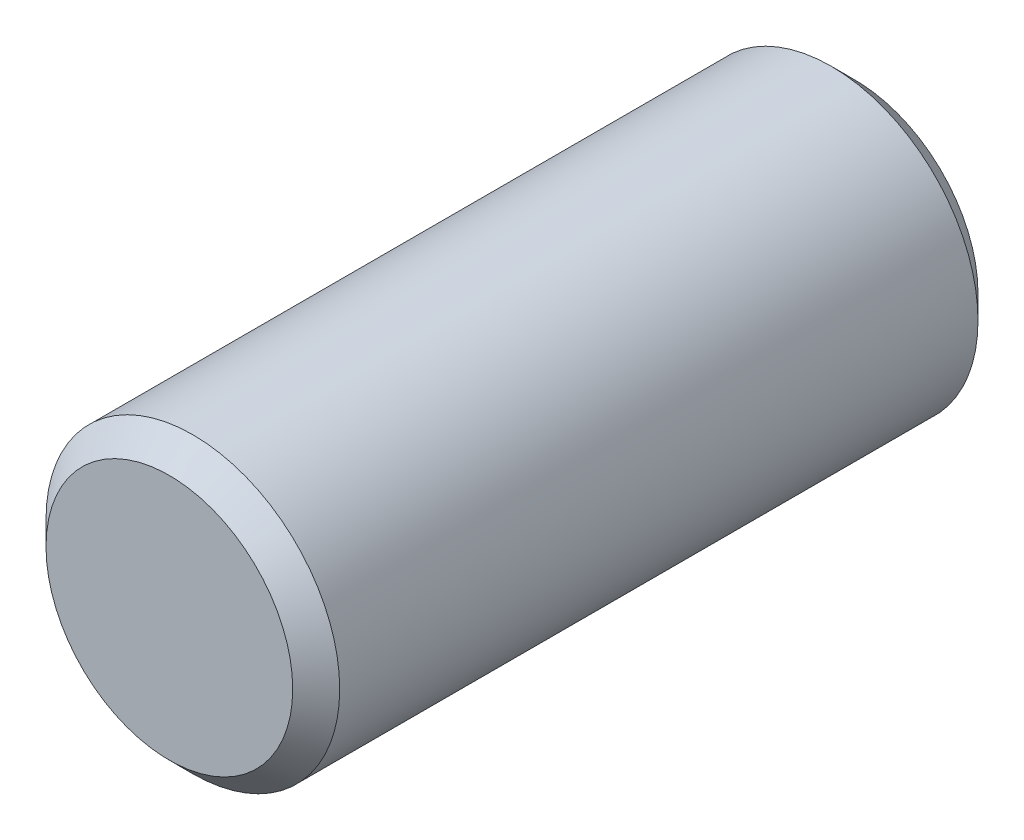
ISO-10303-21;
HEADER;
FILE_DESCRIPTION(('STEP AP214'),'2;1');
FILE_NAME('part.step','',(''),(''),'','','');
FILE_SCHEMA(('AUTOMOTIVE_DESIGN { 1 0 10303 214 1 1 1 1 }'));
ENDSEC;
DATA;
#1=APPLICATION_CONTEXT('core data for automotive mechanical design processes');
#2=APPLICATION_PROTOCOL_DEFINITION('international standard','automotive_design',2000,#1);
#3=PRODUCT_CONTEXT('',#1,'mechanical');
#4=PRODUCT('Part','Part','',(#3));
#5=PRODUCT_RELATED_PRODUCT_CATEGORY('part','',(#4));
#6=PRODUCT_DEFINITION_FORMATION('','',#4);
#7=PRODUCT_DEFINITION_CONTEXT('part definition',#1,'design');
#8=PRODUCT_DEFINITION('design','',#6,#7);
#9=PRODUCT_DEFINITION_SHAPE('','',#8);
#10=(LENGTH_UNIT() NAMED_UNIT(*) SI_UNIT(.MILLI.,.METRE.));
#11=(NAMED_UNIT(*) PLANE_ANGLE_UNIT() SI_UNIT($,.RADIAN.));
#12=(NAMED_UNIT(*) SI_UNIT($,.STERADIAN.) SOLID_ANGLE_UNIT());
#13=UNCERTAINTY_MEASURE_WITH_UNIT(LENGTH_MEASURE(1.E-05),#10,'distance_accuracy_value','');
#14=(GEOMETRIC_REPRESENTATION_CONTEXT(3) GLOBAL_UNCERTAINTY_ASSIGNED_CONTEXT((#13)) GLOBAL_UNIT_ASSIGNED_CONTEXT((#10,
#11,#12)) REPRESENTATION_CONTEXT('',''));
#15=CARTESIAN_POINT('',(0.,0.,0.));
#16=DIRECTION('',(0.,0.,1.));
#17=DIRECTION('',(1.,0.,0.));
#18=AXIS2_PLACEMENT_3D('',#15,#16,#17);
#19=CARTESIAN_POINT('',(0.,0.,0.));
#20=DIRECTION('',(0.,0.,-1.));
#21=DIRECTION('',(-1.,0.,0.));
#22=AXIS2_PLACEMENT_3D('',#19,#20,#21);
#23=PLANE('',#22);
#24=CARTESIAN_POINT('',(0.,0.,0.));
#25=DIRECTION('',(0.,0.,1.));
#26=DIRECTION('',(1.,0.,0.));
#27=AXIS2_PLACEMENT_3D('',#24,#25,#26);
#28=CIRCLE('',#27,2.0002499999805);
#29=CARTESIAN_POINT('',(2.0002499999805,0.,0.));
#30=VERTEX_POINT('',#29);
#31=EDGE_CURVE('E18',#30,#30,#28,.T.);
#32=ORIENTED_EDGE('',*,*,#31,.F.);
#33=EDGE_LOOP('',(#32));
#34=FACE_BOUND('',#33,.T.);
#35=ADVANCED_FACE('F15',(#34),#23,.T.);
#36=CARTESIAN_POINT('',(0.,0.,11.1125));
#37=DIRECTION('',(0.,0.,1.));
#38=DIRECTION('',(1.,0.,0.));
#39=AXIS2_PLACEMENT_3D('',#36,#37,#38);
#40=PLANE('',#39);
#41=CARTESIAN_POINT('',(0.,0.,11.1125000000811));
#42=DIRECTION('',(0.,0.,-1.));
#43=DIRECTION('',(-1.,0.,0.));
#44=AXIS2_PLACEMENT_3D('',#41,#42,#43);
#45=CIRCLE('',#44,2.0002499999805);
#46=CARTESIAN_POINT('',(-2.0002499999805,0.,11.1125000000811));
#47=VERTEX_POINT('',#46);
#48=EDGE_CURVE('E27',#47,#47,#45,.T.);
#49=ORIENTED_EDGE('',*,*,#48,.F.);
#50=EDGE_LOOP('',(#49));
#51=FACE_BOUND('',#50,.T.);
#52=ADVANCED_FACE('F38',(#51),#40,.T.);
#53=CARTESIAN_POINT('',(0.,0.,0.381000000004406));
#54=DIRECTION('',(0.,0.,1.));
#55=DIRECTION('',(1.,0.,0.));
#56=AXIS2_PLACEMENT_3D('',#53,#54,#55);
#57=CONICAL_SURFACE('',#56,2.3812499999849,0.785398163397448);
#58=CARTESIAN_POINT('',(0.,0.,0.381));
#59=DIRECTION('',(0.,0.,1.));
#60=DIRECTION('',(1.,0.,0.));
#61=AXIS2_PLACEMENT_3D('',#58,#59,#60);
#62=CIRCLE('',#61,2.38125);
#63=CARTESIAN_POINT('',(2.38125,0.,0.381));
#64=VERTEX_POINT('',#63);
#65=EDGE_CURVE('E22',#64,#64,#62,.T.);
#66=ORIENTED_EDGE('',*,*,#65,.F.);
#67=EDGE_LOOP('',(#66));
#68=FACE_BOUND('',#67,.T.);
#69=ORIENTED_EDGE('',*,*,#31,.T.);
#70=EDGE_LOOP('',(#69));
#71=FACE_BOUND('',#70,.T.);
#72=ADVANCED_FACE('F35',(#68,#71),#57,.T.);
#73=CARTESIAN_POINT('',(0.,0.,10.7315000000767));
#74=DIRECTION('',(0.,0.,-1.));
#75=DIRECTION('',(-1.,0.,0.));
#76=AXIS2_PLACEMENT_3D('',#73,#74,#75);
#77=CONICAL_SURFACE('',#76,2.38125000004175,0.785398163472046);
#78=CARTESIAN_POINT('',(0.,0.,10.7315));
#79=DIRECTION('',(0.,0.,1.));
#80=DIRECTION('',(1.,0.,0.));
#81=AXIS2_PLACEMENT_3D('',#78,#79,#80);
#82=CIRCLE('',#81,2.38125);
#83=CARTESIAN_POINT('',(2.38125,0.,10.7315));
#84=VERTEX_POINT('',#83);
#85=EDGE_CURVE('E10',#84,#84,#82,.F.);
#86=ORIENTED_EDGE('',*,*,#85,.F.);
#87=EDGE_LOOP('',(#86));
#88=FACE_BOUND('',#87,.T.);
#89=ORIENTED_EDGE('',*,*,#48,.T.);
#90=EDGE_LOOP('',(#89));
#91=FACE_BOUND('',#90,.T.);
#92=ADVANCED_FACE('F46',(#88,#91),#77,.T.);
#93=CARTESIAN_POINT('',(0.,0.,0.));
#94=DIRECTION('',(0.,0.,1.));
#95=DIRECTION('',(1.,0.,0.));
#96=AXIS2_PLACEMENT_3D('',#93,#94,#95);
#97=CYLINDRICAL_SURFACE('',#96,2.38125);
#98=ORIENTED_EDGE('',*,*,#85,.T.);
#99=EDGE_LOOP('',(#98));
#100=FACE_BOUND('',#99,.T.);
#101=ORIENTED_EDGE('',*,*,#65,.T.);
#102=EDGE_LOOP('',(#101));
#103=FACE_BOUND('',#102,.T.);
#104=ADVANCED_FACE('F44',(#100,#103),#97,.T.);
#105=CLOSED_SHELL('',(#35,#52,#72,#92,#104));
#106=MANIFOLD_SOLID_BREP('B1',#105);
#107=ADVANCED_BREP_SHAPE_REPRESENTATION('',(#18,#106),#14);
#108=SHAPE_DEFINITION_REPRESENTATION(#9,#107);
ENDSEC;
END-ISO-10303-21;
